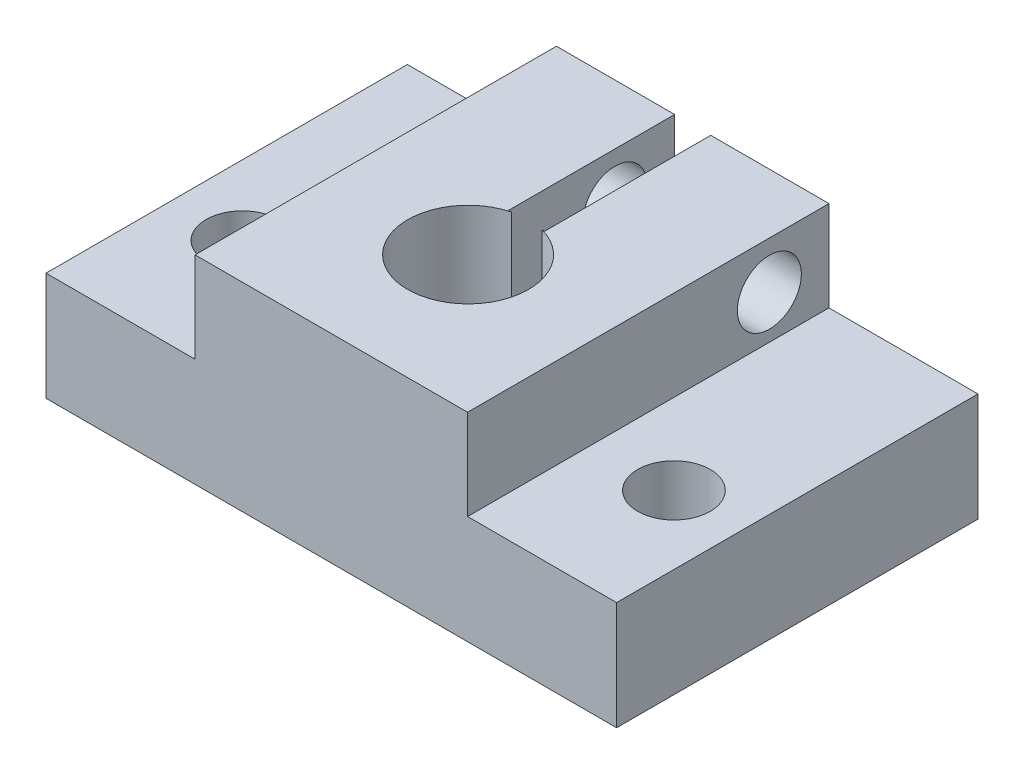
ISO-10303-21;
HEADER;
FILE_DESCRIPTION(('STEP AP214'),'2;1');
FILE_NAME('part.step','',(''),(''),'','','');
FILE_SCHEMA(('AUTOMOTIVE_DESIGN { 1 0 10303 214 1 1 1 1 }'));
ENDSEC;
DATA;
#1=APPLICATION_CONTEXT('core data for automotive mechanical design processes');
#2=APPLICATION_PROTOCOL_DEFINITION('international standard','automotive_design',2000,#1);
#3=PRODUCT_CONTEXT('',#1,'mechanical');
#4=PRODUCT('Part','Part','',(#3));
#5=PRODUCT_RELATED_PRODUCT_CATEGORY('part','',(#4));
#6=PRODUCT_DEFINITION_FORMATION('','',#4);
#7=PRODUCT_DEFINITION_CONTEXT('part definition',#1,'design');
#8=PRODUCT_DEFINITION('design','',#6,#7);
#9=PRODUCT_DEFINITION_SHAPE('','',#8);
#10=(LENGTH_UNIT() NAMED_UNIT(*) SI_UNIT(.MILLI.,.METRE.));
#11=(NAMED_UNIT(*) PLANE_ANGLE_UNIT() SI_UNIT($,.RADIAN.));
#12=(NAMED_UNIT(*) SI_UNIT($,.STERADIAN.) SOLID_ANGLE_UNIT());
#13=UNCERTAINTY_MEASURE_WITH_UNIT(LENGTH_MEASURE(1.E-05),#10,'distance_accuracy_value','');
#14=(GEOMETRIC_REPRESENTATION_CONTEXT(3) GLOBAL_UNCERTAINTY_ASSIGNED_CONTEXT((#13)) GLOBAL_UNIT_ASSIGNED_CONTEXT((#10,
#11,#12)) REPRESENTATION_CONTEXT('',''));
#15=CARTESIAN_POINT('',(0.,0.,0.));
#16=DIRECTION('',(0.,0.,1.));
#17=DIRECTION('',(1.,0.,0.));
#18=AXIS2_PLACEMENT_3D('',#15,#16,#17);
#19=CARTESIAN_POINT('',(0.,0.,0.));
#20=DIRECTION('',(0.,0.,1.));
#21=DIRECTION('',(1.,0.,0.));
#22=AXIS2_PLACEMENT_3D('',#19,#20,#21);
#23=PLANE('',#22);
#24=DIRECTION('',(-1.,0.,0.));
#25=VECTOR('',#24,1.);
#26=CARTESIAN_POINT('',(-9.57708005935853,13.97,0.));
#27=LINE('',#26,#25);
#28=CARTESIAN_POINT('',(-1.27000000000001,13.97,0.));
#29=VERTEX_POINT('',#28);
#30=CARTESIAN_POINT('',(-9.57708005935853,13.97,0.));
#31=VERTEX_POINT('',#30);
#32=EDGE_CURVE('E223',#29,#31,#27,.T.);
#33=ORIENTED_EDGE('',*,*,#32,.F.);
#34=DIRECTION('',(0.,1.,0.));
#35=VECTOR('',#34,1.);
#36=CARTESIAN_POINT('',(-1.27,0.,0.));
#37=LINE('',#36,#35);
#38=CARTESIAN_POINT('',(-1.27,0.,0.));
#39=VERTEX_POINT('',#38);
#40=EDGE_CURVE('E172',#39,#29,#37,.T.);
#41=ORIENTED_EDGE('',*,*,#40,.F.);
#42=DIRECTION('',(1.,0.,0.));
#43=VECTOR('',#42,1.);
#44=CARTESIAN_POINT('',(-20.0525878710987,0.,0.));
#45=LINE('',#44,#43);
#46=CARTESIAN_POINT('',(-20.0525878710987,0.,0.));
#47=VERTEX_POINT('',#46);
#48=EDGE_CURVE('E157',#47,#39,#45,.T.);
#49=ORIENTED_EDGE('',*,*,#48,.F.);
#50=DIRECTION('',(0.,-1.,0.));
#51=VECTOR('',#50,1.);
#52=CARTESIAN_POINT('',(-20.0525878710987,0.,0.));
#53=LINE('',#52,#51);
#54=CARTESIAN_POINT('',(-20.0525878710987,7.62,0.));
#55=VERTEX_POINT('',#54);
#56=EDGE_CURVE('E201',#55,#47,#53,.T.);
#57=ORIENTED_EDGE('',*,*,#56,.F.);
#58=DIRECTION('',(-1.,0.,0.));
#59=VECTOR('',#58,1.);
#60=CARTESIAN_POINT('',(-20.0525878710987,7.62,0.));
#61=LINE('',#60,#59);
#62=CARTESIAN_POINT('',(-9.57708005935853,7.62,0.));
#63=VERTEX_POINT('',#62);
#64=EDGE_CURVE('E229',#63,#55,#61,.T.);
#65=ORIENTED_EDGE('',*,*,#64,.F.);
#66=DIRECTION('',(0.,-1.,0.));
#67=VECTOR('',#66,1.);
#68=CARTESIAN_POINT('',(-9.57708005935853,7.62,0.));
#69=LINE('',#68,#67);
#70=EDGE_CURVE('E227',#31,#63,#69,.T.);
#71=ORIENTED_EDGE('',*,*,#70,.F.);
#72=EDGE_LOOP('',(#33,#41,#49,#57,#65,#71));
#73=FACE_BOUND('',#72,.T.);
#74=ADVANCED_FACE('F36',(#73),#23,.F.);
#75=CARTESIAN_POINT('',(-20.0525878710987,0.,25.4));
#76=DIRECTION('',(0.,1.,0.));
#77=DIRECTION('',(0.,0.,1.));
#78=AXIS2_PLACEMENT_3D('',#75,#76,#77);
#79=PLANE('',#78);
#80=CARTESIAN_POINT('',(15.24,0.,16.5565408878081));
#81=DIRECTION('',(0.,1.,0.));
#82=DIRECTION('',(0.,0.,1.));
#83=AXIS2_PLACEMENT_3D('',#80,#81,#82);
#84=CIRCLE('',#83,2.5527);
#85=CARTESIAN_POINT('',(15.24,0.,19.1092408878081));
#86=VERTEX_POINT('',#85);
#87=EDGE_CURVE('E180',#86,#86,#84,.T.);
#88=ORIENTED_EDGE('',*,*,#87,.T.);
#89=EDGE_LOOP('',(#88));
#90=FACE_BOUND('',#89,.T.);
#91=CARTESIAN_POINT('',(-15.1413002142235,0.,16.51));
#92=DIRECTION('',(0.,1.,0.));
#93=DIRECTION('',(0.,0.,1.));
#94=AXIS2_PLACEMENT_3D('',#91,#92,#93);
#95=CIRCLE('',#94,2.5527);
#96=CARTESIAN_POINT('',(-15.1413002142235,0.,19.0627));
#97=VERTEX_POINT('',#96);
#98=EDGE_CURVE('E174',#97,#97,#95,.T.);
#99=ORIENTED_EDGE('',*,*,#98,.T.);
#100=EDGE_LOOP('',(#99));
#101=FACE_BOUND('',#100,.T.);
#102=DIRECTION('',(0.99198409888826,0.,0.126362761733219));
#103=VECTOR('',#102,1.);
#104=CARTESIAN_POINT('',(1.27000000000001,0.,11.6999309648274));
#105=LINE('',#104,#103);
#106=CARTESIAN_POINT('',(1.06547372781316,0.,11.6738776191845));
#107=VERTEX_POINT('',#106);
#108=CARTESIAN_POINT('',(1.27000000000001,0.,11.6999309648274));
#109=VERTEX_POINT('',#108);
#110=EDGE_CURVE('E60',#107,#109,#105,.T.);
#111=ORIENTED_EDGE('',*,*,#110,.T.);
#112=DIRECTION('',(0.,0.,-1.));
#113=VECTOR('',#112,1.);
#114=CARTESIAN_POINT('',(1.27000000000001,0.,11.6999309648274));
#115=LINE('',#114,#113);
#116=CARTESIAN_POINT('',(1.27,0.,0.));
#117=VERTEX_POINT('',#116);
#118=EDGE_CURVE('E145',#109,#117,#115,.T.);
#119=ORIENTED_EDGE('',*,*,#118,.T.);
#120=CARTESIAN_POINT('',(20.0525878710987,0.,0.));
#121=VERTEX_POINT('',#120);
#122=EDGE_CURVE('E194',#117,#121,#45,.T.);
#123=ORIENTED_EDGE('',*,*,#122,.T.);
#124=DIRECTION('',(0.,0.,-1.));
#125=VECTOR('',#124,1.);
#126=CARTESIAN_POINT('',(20.0525878710987,0.,25.4));
#127=LINE('',#126,#125);
#128=CARTESIAN_POINT('',(20.0525878710987,0.,25.4));
#129=VERTEX_POINT('',#128);
#130=EDGE_CURVE('E251',#129,#121,#127,.T.);
#131=ORIENTED_EDGE('',*,*,#130,.F.);
#132=DIRECTION('',(1.,0.,0.));
#133=VECTOR('',#132,1.);
#134=CARTESIAN_POINT('',(-20.0525878710987,0.,25.4));
#135=LINE('',#134,#133);
#136=CARTESIAN_POINT('',(-20.0525878710987,0.,25.4));
#137=VERTEX_POINT('',#136);
#138=EDGE_CURVE('E197',#137,#129,#135,.T.);
#139=ORIENTED_EDGE('',*,*,#138,.F.);
#140=DIRECTION('',(0.,0.,-1.));
#141=VECTOR('',#140,1.);
#142=CARTESIAN_POINT('',(-20.0525878710987,0.,25.4));
#143=LINE('',#142,#141);
#144=EDGE_CURVE('E215',#137,#47,#143,.T.);
#145=ORIENTED_EDGE('',*,*,#144,.T.);
#146=ORIENTED_EDGE('',*,*,#48,.T.);
#147=DIRECTION('',(0.,0.,1.));
#148=VECTOR('',#147,1.);
#149=CARTESIAN_POINT('',(-1.27,0.,11.6999309648274));
#150=LINE('',#149,#148);
#151=CARTESIAN_POINT('',(-1.27,0.,11.6999309648274));
#152=VERTEX_POINT('',#151);
#153=EDGE_CURVE('E140',#39,#152,#150,.T.);
#154=ORIENTED_EDGE('',*,*,#153,.T.);
#155=DIRECTION('',(0.99198409888826,0.,-0.126362761733219));
#156=VECTOR('',#155,1.);
#157=CARTESIAN_POINT('',(-1.27,0.,11.6999309648274));
#158=LINE('',#157,#156);
#159=CARTESIAN_POINT('',(-1.06547372781316,0.,11.6738776191845));
#160=VERTEX_POINT('',#159);
#161=EDGE_CURVE('E148',#152,#160,#158,.T.);
#162=ORIENTED_EDGE('',*,*,#161,.T.);
#163=CARTESIAN_POINT('',(0.,0.,15.7881534649853));
#164=DIRECTION('',(0.,1.,0.));
#165=DIRECTION('',(0.,0.,1.));
#166=AXIS2_PLACEMENT_3D('',#163,#164,#165);
#167=CIRCLE('',#166,4.25);
#168=EDGE_CURVE('E192',#160,#107,#167,.T.);
#169=ORIENTED_EDGE('',*,*,#168,.T.);
#170=EDGE_LOOP('',(#111,#119,#123,#131,#139,#145,#146,#154,#162,#169));
#171=FACE_BOUND('',#170,.T.);
#172=ADVANCED_FACE('F38',(#90,#101,#171),#79,.F.);
#173=CARTESIAN_POINT('',(20.0525878710987,0.,25.4));
#174=DIRECTION('',(-1.,0.,0.));
#175=DIRECTION('',(0.,-1.,0.));
#176=AXIS2_PLACEMENT_3D('',#173,#174,#175);
#177=PLANE('',#176);
#178=DIRECTION('',(0.,1.,0.));
#179=VECTOR('',#178,1.);
#180=CARTESIAN_POINT('',(20.0525878710987,0.,0.));
#181=LINE('',#180,#179);
#182=CARTESIAN_POINT('',(20.0525878710987,7.62,0.));
#183=VERTEX_POINT('',#182);
#184=EDGE_CURVE('E217',#121,#183,#181,.T.);
#185=ORIENTED_EDGE('',*,*,#184,.T.);
#186=DIRECTION('',(0.,0.,-1.));
#187=VECTOR('',#186,1.);
#188=CARTESIAN_POINT('',(20.0525878710987,7.62,25.4));
#189=LINE('',#188,#187);
#190=CARTESIAN_POINT('',(20.0525878710987,7.62,25.4));
#191=VERTEX_POINT('',#190);
#192=EDGE_CURVE('E248',#191,#183,#189,.T.);
#193=ORIENTED_EDGE('',*,*,#192,.F.);
#194=DIRECTION('',(0.,1.,0.));
#195=VECTOR('',#194,1.);
#196=CARTESIAN_POINT('',(20.0525878710987,0.,25.4));
#197=LINE('',#196,#195);
#198=EDGE_CURVE('E200',#129,#191,#197,.T.);
#199=ORIENTED_EDGE('',*,*,#198,.F.);
#200=ORIENTED_EDGE('',*,*,#130,.T.);
#201=EDGE_LOOP('',(#185,#193,#199,#200));
#202=FACE_BOUND('',#201,.T.);
#203=ADVANCED_FACE('F275',(#202),#177,.F.);
#204=CARTESIAN_POINT('',(20.0525878710987,7.62,25.4));
#205=DIRECTION('',(0.,-1.,0.));
#206=DIRECTION('',(0.,0.,-1.));
#207=AXIS2_PLACEMENT_3D('',#204,#205,#206);
#208=PLANE('',#207);
#209=CARTESIAN_POINT('',(15.24,7.62,16.5565408878081));
#210=DIRECTION('',(0.,1.,0.));
#211=DIRECTION('',(0.,0.,1.));
#212=AXIS2_PLACEMENT_3D('',#209,#210,#211);
#213=CIRCLE('',#212,2.5527);
#214=CARTESIAN_POINT('',(15.24,7.62,19.1092408878081));
#215=VERTEX_POINT('',#214);
#216=EDGE_CURVE('E184',#215,#215,#213,.T.);
#217=ORIENTED_EDGE('',*,*,#216,.F.);
#218=EDGE_LOOP('',(#217));
#219=FACE_BOUND('',#218,.T.);
#220=DIRECTION('',(-1.,0.,0.));
#221=VECTOR('',#220,1.);
#222=CARTESIAN_POINT('',(20.0525878710987,7.62,0.));
#223=LINE('',#222,#221);
#224=CARTESIAN_POINT('',(9.57708005935853,7.62,0.));
#225=VERTEX_POINT('',#224);
#226=EDGE_CURVE('E219',#183,#225,#223,.T.);
#227=ORIENTED_EDGE('',*,*,#226,.T.);
#228=DIRECTION('',(0.,0.,-1.));
#229=VECTOR('',#228,1.);
#230=CARTESIAN_POINT('',(9.57708005935853,7.62,25.4));
#231=LINE('',#230,#229);
#232=CARTESIAN_POINT('',(9.57708005935853,7.62,25.4));
#233=VERTEX_POINT('',#232);
#234=EDGE_CURVE('E245',#233,#225,#231,.T.);
#235=ORIENTED_EDGE('',*,*,#234,.F.);
#236=DIRECTION('',(-1.,0.,0.));
#237=VECTOR('',#236,1.);
#238=CARTESIAN_POINT('',(20.0525878710987,7.62,25.4));
#239=LINE('',#238,#237);
#240=EDGE_CURVE('E203',#191,#233,#239,.T.);
#241=ORIENTED_EDGE('',*,*,#240,.F.);
#242=ORIENTED_EDGE('',*,*,#192,.T.);
#243=EDGE_LOOP('',(#227,#235,#241,#242));
#244=FACE_BOUND('',#243,.T.);
#245=ADVANCED_FACE('F303',(#219,#244),#208,.F.);
#246=CARTESIAN_POINT('',(9.57708005935853,7.62,25.4));
#247=DIRECTION('',(-1.,0.,0.));
#248=DIRECTION('',(0.,-1.,0.));
#249=AXIS2_PLACEMENT_3D('',#246,#247,#248);
#250=PLANE('',#249);
#251=CARTESIAN_POINT('',(9.57708005935854,10.668,4.18904708695258));
#252=DIRECTION('',(1.,0.,0.));
#253=DIRECTION('',(0.,0.,-1.));
#254=AXIS2_PLACEMENT_3D('',#251,#252,#253);
#255=CIRCLE('',#254,2.249932);
#256=CARTESIAN_POINT('',(9.57708005935854,10.668,1.93911508695258));
#257=VERTEX_POINT('',#256);
#258=EDGE_CURVE('E367',#257,#257,#255,.T.);
#259=ORIENTED_EDGE('',*,*,#258,.F.);
#260=EDGE_LOOP('',(#259));
#261=FACE_BOUND('',#260,.T.);
#262=DIRECTION('',(0.,1.,0.));
#263=VECTOR('',#262,1.);
#264=CARTESIAN_POINT('',(9.57708005935853,7.62,0.));
#265=LINE('',#264,#263);
#266=CARTESIAN_POINT('',(9.57708005935853,13.97,0.));
#267=VERTEX_POINT('',#266);
#268=EDGE_CURVE('E221',#225,#267,#265,.T.);
#269=ORIENTED_EDGE('',*,*,#268,.T.);
#270=DIRECTION('',(0.,0.,-1.));
#271=VECTOR('',#270,1.);
#272=CARTESIAN_POINT('',(9.57708005935853,13.97,25.4));
#273=LINE('',#272,#271);
#274=CARTESIAN_POINT('',(9.57708005935853,13.97,25.4));
#275=VERTEX_POINT('',#274);
#276=EDGE_CURVE('E242',#275,#267,#273,.T.);
#277=ORIENTED_EDGE('',*,*,#276,.F.);
#278=DIRECTION('',(0.,1.,0.));
#279=VECTOR('',#278,1.);
#280=CARTESIAN_POINT('',(9.57708005935853,7.62,25.4));
#281=LINE('',#280,#279);
#282=EDGE_CURVE('E205',#233,#275,#281,.T.);
#283=ORIENTED_EDGE('',*,*,#282,.F.);
#284=ORIENTED_EDGE('',*,*,#234,.T.);
#285=EDGE_LOOP('',(#269,#277,#283,#284));
#286=FACE_BOUND('',#285,.T.);
#287=ADVANCED_FACE('F299',(#261,#286),#250,.F.);
#288=CARTESIAN_POINT('',(-9.57708005935853,13.97,25.4));
#289=DIRECTION('',(0.,-1.,0.));
#290=DIRECTION('',(1.,0.,0.));
#291=AXIS2_PLACEMENT_3D('',#288,#289,#290);
#292=PLANE('',#291);
#293=CARTESIAN_POINT('',(1.27,13.97,0.));
#294=VERTEX_POINT('',#293);
#295=EDGE_CURVE('E224',#267,#294,#27,.T.);
#296=ORIENTED_EDGE('',*,*,#295,.T.);
#297=DIRECTION('',(0.,0.,-1.));
#298=VECTOR('',#297,1.);
#299=CARTESIAN_POINT('',(1.27000000000001,13.97,11.6999309648274));
#300=LINE('',#299,#298);
#301=CARTESIAN_POINT('',(1.27000000000001,13.97,11.6999309648274));
#302=VERTEX_POINT('',#301);
#303=EDGE_CURVE('E158',#302,#294,#300,.T.);
#304=ORIENTED_EDGE('',*,*,#303,.F.);
#305=DIRECTION('',(0.99198409888826,0.,0.126362761733219));
#306=VECTOR('',#305,1.);
#307=CARTESIAN_POINT('',(1.27000000000001,13.97,11.6999309648274));
#308=LINE('',#307,#306);
#309=CARTESIAN_POINT('',(1.06547372781316,13.97,11.6738776191845));
#310=VERTEX_POINT('',#309);
#311=EDGE_CURVE('E160',#310,#302,#308,.T.);
#312=ORIENTED_EDGE('',*,*,#311,.F.);
#313=CARTESIAN_POINT('',(0.,13.97,15.7881534649853));
#314=DIRECTION('',(0.,1.,0.));
#315=DIRECTION('',(0.,0.,1.));
#316=AXIS2_PLACEMENT_3D('',#313,#314,#315);
#317=CIRCLE('',#316,4.25);
#318=CARTESIAN_POINT('',(-1.06547372781316,13.97,11.6738776191845));
#319=VERTEX_POINT('',#318);
#320=EDGE_CURVE('E183',#319,#310,#317,.T.);
#321=ORIENTED_EDGE('',*,*,#320,.F.);
#322=DIRECTION('',(0.99198409888826,0.,-0.126362761733219));
#323=VECTOR('',#322,1.);
#324=CARTESIAN_POINT('',(-1.27,13.97,11.6999309648274));
#325=LINE('',#324,#323);
#326=CARTESIAN_POINT('',(-1.27,13.97,11.6999309648274));
#327=VERTEX_POINT('',#326);
#328=EDGE_CURVE('E52',#327,#319,#325,.T.);
#329=ORIENTED_EDGE('',*,*,#328,.F.);
#330=DIRECTION('',(0.,0.,1.));
#331=VECTOR('',#330,1.);
#332=CARTESIAN_POINT('',(-1.27,13.97,11.6999309648274));
#333=LINE('',#332,#331);
#334=EDGE_CURVE('E143',#29,#327,#333,.T.);
#335=ORIENTED_EDGE('',*,*,#334,.F.);
#336=ORIENTED_EDGE('',*,*,#32,.T.);
#337=DIRECTION('',(0.,0.,-1.));
#338=VECTOR('',#337,1.);
#339=CARTESIAN_POINT('',(-9.57708005935853,13.97,25.4));
#340=LINE('',#339,#338);
#341=CARTESIAN_POINT('',(-9.57708005935853,13.97,25.4));
#342=VERTEX_POINT('',#341);
#343=EDGE_CURVE('E239',#342,#31,#340,.T.);
#344=ORIENTED_EDGE('',*,*,#343,.F.);
#345=DIRECTION('',(-1.,0.,0.));
#346=VECTOR('',#345,1.);
#347=CARTESIAN_POINT('',(-9.57708005935853,13.97,25.4));
#348=LINE('',#347,#346);
#349=EDGE_CURVE('E207',#275,#342,#348,.T.);
#350=ORIENTED_EDGE('',*,*,#349,.F.);
#351=ORIENTED_EDGE('',*,*,#276,.T.);
#352=EDGE_LOOP('',(#296,#304,#312,#321,#329,#335,#336,#344,#350,#351));
#353=FACE_BOUND('',#352,.T.);
#354=ADVANCED_FACE('F259',(#353),#292,.F.);
#355=CARTESIAN_POINT('',(-9.57708005935853,7.62,25.4));
#356=DIRECTION('',(1.,0.,0.));
#357=DIRECTION('',(0.,0.,-1.));
#358=AXIS2_PLACEMENT_3D('',#355,#356,#357);
#359=PLANE('',#358);
#360=CARTESIAN_POINT('',(-9.57708005935853,10.668,4.18904708695258));
#361=DIRECTION('',(1.,0.,0.));
#362=DIRECTION('',(0.,0.,-1.));
#363=AXIS2_PLACEMENT_3D('',#360,#361,#362);
#364=CIRCLE('',#363,2.249932);
#365=CARTESIAN_POINT('',(-9.57708005935853,10.668,1.93911508695258));
#366=VERTEX_POINT('',#365);
#367=EDGE_CURVE('E163',#366,#366,#364,.T.);
#368=ORIENTED_EDGE('',*,*,#367,.T.);
#369=EDGE_LOOP('',(#368));
#370=FACE_BOUND('',#369,.T.);
#371=ORIENTED_EDGE('',*,*,#70,.T.);
#372=DIRECTION('',(0.,0.,-1.));
#373=VECTOR('',#372,1.);
#374=CARTESIAN_POINT('',(-9.57708005935853,7.62,25.4));
#375=LINE('',#374,#373);
#376=CARTESIAN_POINT('',(-9.57708005935853,7.62,25.4));
#377=VERTEX_POINT('',#376);
#378=EDGE_CURVE('E236',#377,#63,#375,.T.);
#379=ORIENTED_EDGE('',*,*,#378,.F.);
#380=DIRECTION('',(0.,-1.,0.));
#381=VECTOR('',#380,1.);
#382=CARTESIAN_POINT('',(-9.57708005935853,7.62,25.4));
#383=LINE('',#382,#381);
#384=EDGE_CURVE('E209',#342,#377,#383,.T.);
#385=ORIENTED_EDGE('',*,*,#384,.F.);
#386=ORIENTED_EDGE('',*,*,#343,.T.);
#387=EDGE_LOOP('',(#371,#379,#385,#386));
#388=FACE_BOUND('',#387,.T.);
#389=ADVANCED_FACE('F294',(#370,#388),#359,.F.);
#390=CARTESIAN_POINT('',(-20.0525878710987,7.62,25.4));
#391=DIRECTION('',(0.,-1.,0.));
#392=DIRECTION('',(0.,0.,-1.));
#393=AXIS2_PLACEMENT_3D('',#390,#391,#392);
#394=PLANE('',#393);
#395=CARTESIAN_POINT('',(-15.1413002142235,7.62,16.51));
#396=DIRECTION('',(0.,1.,0.));
#397=DIRECTION('',(0.,0.,1.));
#398=AXIS2_PLACEMENT_3D('',#395,#396,#397);
#399=CIRCLE('',#398,2.5527);
#400=CARTESIAN_POINT('',(-15.1413002142235,7.62,19.0627));
#401=VERTEX_POINT('',#400);
#402=EDGE_CURVE('E187',#401,#401,#399,.T.);
#403=ORIENTED_EDGE('',*,*,#402,.F.);
#404=EDGE_LOOP('',(#403));
#405=FACE_BOUND('',#404,.T.);
#406=ORIENTED_EDGE('',*,*,#64,.T.);
#407=DIRECTION('',(0.,0.,-1.));
#408=VECTOR('',#407,1.);
#409=CARTESIAN_POINT('',(-20.0525878710987,7.62,25.4));
#410=LINE('',#409,#408);
#411=CARTESIAN_POINT('',(-20.0525878710987,7.62,25.4));
#412=VERTEX_POINT('',#411);
#413=EDGE_CURVE('E233',#412,#55,#410,.T.);
#414=ORIENTED_EDGE('',*,*,#413,.F.);
#415=DIRECTION('',(-1.,0.,0.));
#416=VECTOR('',#415,1.);
#417=CARTESIAN_POINT('',(-20.0525878710987,7.62,25.4));
#418=LINE('',#417,#416);
#419=EDGE_CURVE('E211',#377,#412,#418,.T.);
#420=ORIENTED_EDGE('',*,*,#419,.F.);
#421=ORIENTED_EDGE('',*,*,#378,.T.);
#422=EDGE_LOOP('',(#406,#414,#420,#421));
#423=FACE_BOUND('',#422,.T.);
#424=ADVANCED_FACE('F332',(#405,#423),#394,.F.);
#425=CARTESIAN_POINT('',(-20.0525878710987,0.,25.4));
#426=DIRECTION('',(1.,0.,0.));
#427=DIRECTION('',(0.,1.,0.));
#428=AXIS2_PLACEMENT_3D('',#425,#426,#427);
#429=PLANE('',#428);
#430=ORIENTED_EDGE('',*,*,#56,.T.);
#431=ORIENTED_EDGE('',*,*,#144,.F.);
#432=DIRECTION('',(0.,-1.,0.));
#433=VECTOR('',#432,1.);
#434=CARTESIAN_POINT('',(-20.0525878710987,0.,25.4));
#435=LINE('',#434,#433);
#436=EDGE_CURVE('E213',#412,#137,#435,.T.);
#437=ORIENTED_EDGE('',*,*,#436,.F.);
#438=ORIENTED_EDGE('',*,*,#413,.T.);
#439=EDGE_LOOP('',(#430,#431,#437,#438));
#440=FACE_BOUND('',#439,.T.);
#441=ADVANCED_FACE('F284',(#440),#429,.F.);
#442=CARTESIAN_POINT('',(0.,0.,25.4));
#443=DIRECTION('',(0.,0.,1.));
#444=DIRECTION('',(1.,0.,0.));
#445=AXIS2_PLACEMENT_3D('',#442,#443,#444);
#446=PLANE('',#445);
#447=ORIENTED_EDGE('',*,*,#138,.T.);
#448=ORIENTED_EDGE('',*,*,#198,.T.);
#449=ORIENTED_EDGE('',*,*,#240,.T.);
#450=ORIENTED_EDGE('',*,*,#282,.T.);
#451=ORIENTED_EDGE('',*,*,#349,.T.);
#452=ORIENTED_EDGE('',*,*,#384,.T.);
#453=ORIENTED_EDGE('',*,*,#419,.T.);
#454=ORIENTED_EDGE('',*,*,#436,.T.);
#455=EDGE_LOOP('',(#447,#448,#449,#450,#451,#452,#453,#454));
#456=FACE_BOUND('',#455,.T.);
#457=ADVANCED_FACE('F279',(#456),#446,.T.);
#458=ORIENTED_EDGE('',*,*,#122,.F.);
#459=DIRECTION('',(0.,1.,0.));
#460=VECTOR('',#459,1.);
#461=CARTESIAN_POINT('',(1.27,0.,0.));
#462=LINE('',#461,#460);
#463=EDGE_CURVE('E175',#117,#294,#462,.T.);
#464=ORIENTED_EDGE('',*,*,#463,.T.);
#465=ORIENTED_EDGE('',*,*,#295,.F.);
#466=ORIENTED_EDGE('',*,*,#268,.F.);
#467=ORIENTED_EDGE('',*,*,#226,.F.);
#468=ORIENTED_EDGE('',*,*,#184,.F.);
#469=EDGE_LOOP('',(#458,#464,#465,#466,#467,#468));
#470=FACE_BOUND('',#469,.T.);
#471=ADVANCED_FACE('F269',(#470),#23,.F.);
#472=CARTESIAN_POINT('',(0.,0.,15.7881534649853));
#473=DIRECTION('',(0.,1.,0.));
#474=DIRECTION('',(0.,0.,1.));
#475=AXIS2_PLACEMENT_3D('',#472,#473,#474);
#476=CYLINDRICAL_SURFACE('',#475,4.25);
#477=ORIENTED_EDGE('',*,*,#320,.T.);
#478=DIRECTION('',(0.,1.,0.));
#479=VECTOR('',#478,1.);
#480=CARTESIAN_POINT('',(1.06547372781316,0.,11.6738776191845));
#481=LINE('',#480,#479);
#482=EDGE_CURVE('E11',#310,#107,#481,.F.);
#483=ORIENTED_EDGE('',*,*,#482,.T.);
#484=ORIENTED_EDGE('',*,*,#168,.F.);
#485=DIRECTION('',(0.,1.,0.));
#486=VECTOR('',#485,1.);
#487=CARTESIAN_POINT('',(-1.06547372781316,0.,11.6738776191845));
#488=LINE('',#487,#486);
#489=EDGE_CURVE('E45',#160,#319,#488,.T.);
#490=ORIENTED_EDGE('',*,*,#489,.T.);
#491=EDGE_LOOP('',(#477,#483,#484,#490));
#492=FACE_BOUND('',#491,.T.);
#493=ADVANCED_FACE('F256',(#492),#476,.F.);
#494=CARTESIAN_POINT('',(-15.1413002142235,0.,16.51));
#495=DIRECTION('',(0.,1.,0.));
#496=DIRECTION('',(0.,0.,1.));
#497=AXIS2_PLACEMENT_3D('',#494,#495,#496);
#498=CYLINDRICAL_SURFACE('',#497,2.5527);
#499=ORIENTED_EDGE('',*,*,#98,.F.);
#500=EDGE_LOOP('',(#499));
#501=FACE_BOUND('',#500,.T.);
#502=ORIENTED_EDGE('',*,*,#402,.T.);
#503=EDGE_LOOP('',(#502));
#504=FACE_BOUND('',#503,.T.);
#505=ADVANCED_FACE('F327',(#501,#504),#498,.F.);
#506=CARTESIAN_POINT('',(15.24,0.,16.5565408878081));
#507=DIRECTION('',(0.,1.,0.));
#508=DIRECTION('',(0.,0.,1.));
#509=AXIS2_PLACEMENT_3D('',#506,#507,#508);
#510=CYLINDRICAL_SURFACE('',#509,2.5527);
#511=ORIENTED_EDGE('',*,*,#87,.F.);
#512=EDGE_LOOP('',(#511));
#513=FACE_BOUND('',#512,.T.);
#514=ORIENTED_EDGE('',*,*,#216,.T.);
#515=EDGE_LOOP('',(#514));
#516=FACE_BOUND('',#515,.T.);
#517=ADVANCED_FACE('F336',(#513,#516),#510,.F.);
#518=CARTESIAN_POINT('',(-1.27,0.,11.6999309648274));
#519=DIRECTION('',(0.126362761733219,0.,0.99198409888826));
#520=DIRECTION('',(0.99198409888826,0.,-0.126362761733219));
#521=AXIS2_PLACEMENT_3D('',#518,#519,#520);
#522=PLANE('',#521);
#523=ORIENTED_EDGE('',*,*,#161,.F.);
#524=DIRECTION('',(0.,1.,0.));
#525=VECTOR('',#524,1.);
#526=CARTESIAN_POINT('',(-1.27,0.,11.6999309648274));
#527=LINE('',#526,#525);
#528=EDGE_CURVE('E136',#152,#327,#527,.T.);
#529=ORIENTED_EDGE('',*,*,#528,.T.);
#530=ORIENTED_EDGE('',*,*,#328,.T.);
#531=ORIENTED_EDGE('',*,*,#489,.F.);
#532=EDGE_LOOP('',(#523,#529,#530,#531));
#533=FACE_BOUND('',#532,.T.);
#534=ADVANCED_FACE('F149',(#533),#522,.F.);
#535=CARTESIAN_POINT('',(-1.27,0.,11.6999309648274));
#536=DIRECTION('',(-1.,0.,0.));
#537=DIRECTION('',(0.,-1.,0.));
#538=AXIS2_PLACEMENT_3D('',#535,#536,#537);
#539=PLANE('',#538);
#540=CARTESIAN_POINT('',(-1.27,10.668,4.18904708695258));
#541=DIRECTION('',(-1.,0.,0.));
#542=DIRECTION('',(0.,-1.,0.));
#543=AXIS2_PLACEMENT_3D('',#540,#541,#542);
#544=CIRCLE('',#543,2.249932);
#545=CARTESIAN_POINT('',(-1.27,8.418068,4.18904708695258));
#546=VERTEX_POINT('',#545);
#547=EDGE_CURVE('E362',#546,#546,#544,.T.);
#548=ORIENTED_EDGE('',*,*,#547,.T.);
#549=EDGE_LOOP('',(#548));
#550=FACE_BOUND('',#549,.T.);
#551=ORIENTED_EDGE('',*,*,#334,.T.);
#552=ORIENTED_EDGE('',*,*,#528,.F.);
#553=ORIENTED_EDGE('',*,*,#153,.F.);
#554=ORIENTED_EDGE('',*,*,#40,.T.);
#555=EDGE_LOOP('',(#551,#552,#553,#554));
#556=FACE_BOUND('',#555,.T.);
#557=ADVANCED_FACE('F138',(#550,#556),#539,.F.);
#558=CARTESIAN_POINT('',(1.27000000000001,0.,11.6999309648274));
#559=DIRECTION('',(-0.126362761733219,0.,0.99198409888826));
#560=DIRECTION('',(0.99198409888826,0.,0.126362761733219));
#561=AXIS2_PLACEMENT_3D('',#558,#559,#560);
#562=PLANE('',#561);
#563=ORIENTED_EDGE('',*,*,#311,.T.);
#564=DIRECTION('',(0.,1.,0.));
#565=VECTOR('',#564,1.);
#566=CARTESIAN_POINT('',(1.27000000000001,0.,11.6999309648274));
#567=LINE('',#566,#565);
#568=EDGE_CURVE('E144',#109,#302,#567,.T.);
#569=ORIENTED_EDGE('',*,*,#568,.F.);
#570=ORIENTED_EDGE('',*,*,#110,.F.);
#571=ORIENTED_EDGE('',*,*,#482,.F.);
#572=EDGE_LOOP('',(#563,#569,#570,#571));
#573=FACE_BOUND('',#572,.T.);
#574=ADVANCED_FACE('F261',(#573),#562,.F.);
#575=CARTESIAN_POINT('',(1.27000000000001,0.,11.6999309648274));
#576=DIRECTION('',(1.,0.,0.));
#577=DIRECTION('',(0.,0.,-1.));
#578=AXIS2_PLACEMENT_3D('',#575,#576,#577);
#579=PLANE('',#578);
#580=CARTESIAN_POINT('',(1.27,10.668,4.18904708695258));
#581=DIRECTION('',(1.,0.,0.));
#582=DIRECTION('',(0.,0.,-1.));
#583=AXIS2_PLACEMENT_3D('',#580,#581,#582);
#584=CIRCLE('',#583,2.249932);
#585=CARTESIAN_POINT('',(1.27,10.668,1.93911508695258));
#586=VERTEX_POINT('',#585);
#587=EDGE_CURVE('E40',#586,#586,#584,.T.);
#588=ORIENTED_EDGE('',*,*,#587,.T.);
#589=EDGE_LOOP('',(#588));
#590=FACE_BOUND('',#589,.T.);
#591=ORIENTED_EDGE('',*,*,#303,.T.);
#592=ORIENTED_EDGE('',*,*,#463,.F.);
#593=ORIENTED_EDGE('',*,*,#118,.F.);
#594=ORIENTED_EDGE('',*,*,#568,.T.);
#595=EDGE_LOOP('',(#591,#592,#593,#594));
#596=FACE_BOUND('',#595,.T.);
#597=ADVANCED_FACE('F264',(#590,#596),#579,.F.);
#598=CARTESIAN_POINT('',(-20.0525878710987,10.668,4.18904708695258));
#599=DIRECTION('',(1.,0.,0.));
#600=DIRECTION('',(0.,0.,-1.));
#601=AXIS2_PLACEMENT_3D('',#598,#599,#600);
#602=CYLINDRICAL_SURFACE('',#601,2.249932);
#603=ORIENTED_EDGE('',*,*,#258,.T.);
#604=EDGE_LOOP('',(#603));
#605=FACE_BOUND('',#604,.T.);
#606=ORIENTED_EDGE('',*,*,#587,.F.);
#607=EDGE_LOOP('',(#606));
#608=FACE_BOUND('',#607,.T.);
#609=ADVANCED_FACE('F350',(#605,#608),#602,.F.);
#610=ORIENTED_EDGE('',*,*,#547,.F.);
#611=EDGE_LOOP('',(#610));
#612=FACE_BOUND('',#611,.T.);
#613=ORIENTED_EDGE('',*,*,#367,.F.);
#614=EDGE_LOOP('',(#613));
#615=FACE_BOUND('',#614,.T.);
#616=ADVANCED_FACE('F352',(#612,#615),#602,.F.);
#617=CLOSED_SHELL('',(#74,#172,#203,#245,#287,#354,#389,#424,#441,#457,#471,#493,#505,#517,#534,
#557,#574,#597,#609,#616));
#618=MANIFOLD_SOLID_BREP('B2',#617);
#619=ADVANCED_BREP_SHAPE_REPRESENTATION('',(#18,#618),#14);
#620=SHAPE_DEFINITION_REPRESENTATION(#9,#619);
ENDSEC;
END-ISO-10303-21;
